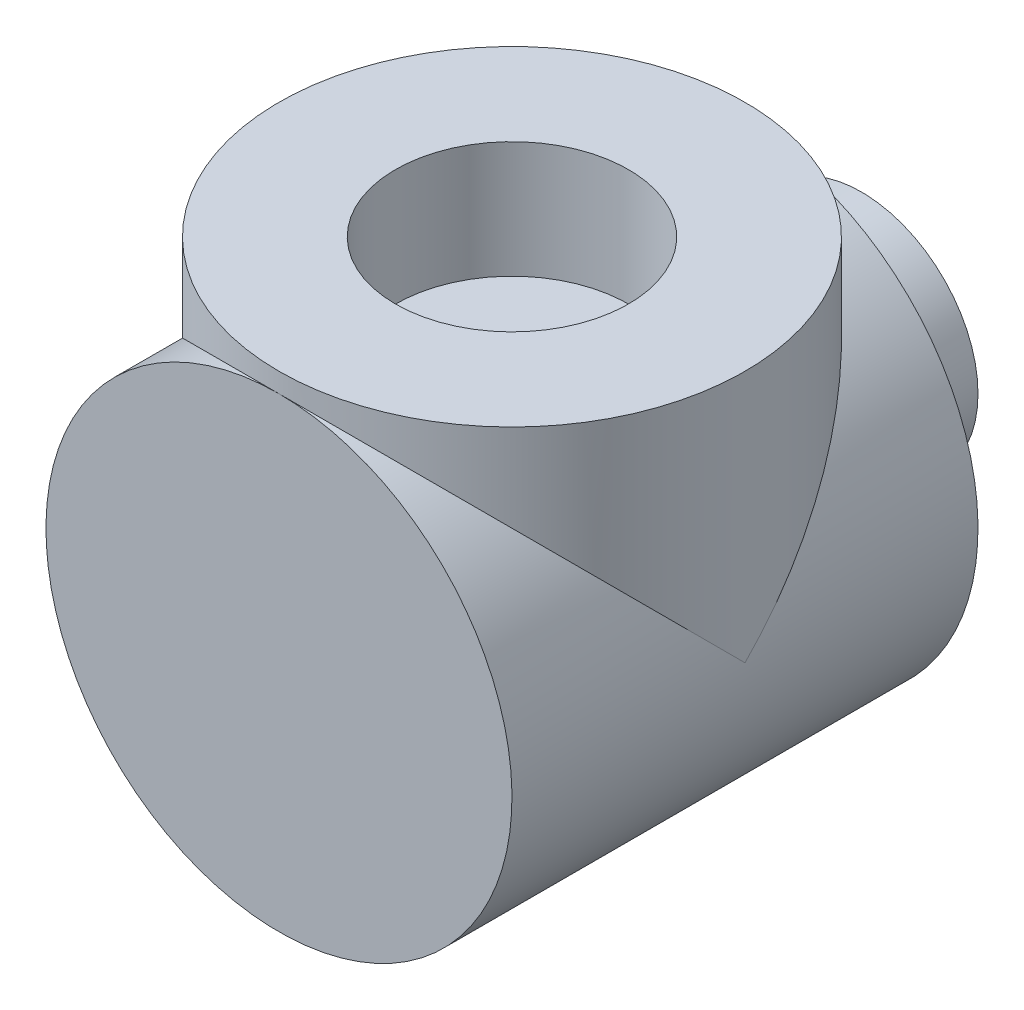
ISO-10303-21;
HEADER;
FILE_DESCRIPTION(('STEP AP214'),'2;1');
FILE_NAME('part.step','',(''),(''),'','','');
FILE_SCHEMA(('AUTOMOTIVE_DESIGN { 1 0 10303 214 1 1 1 1 }'));
ENDSEC;
DATA;
#1=APPLICATION_CONTEXT('core data for automotive mechanical design processes');
#2=APPLICATION_PROTOCOL_DEFINITION('international standard','automotive_design',2000,#1);
#3=PRODUCT_CONTEXT('',#1,'mechanical');
#4=PRODUCT('Part','Part','',(#3));
#5=PRODUCT_RELATED_PRODUCT_CATEGORY('part','',(#4));
#6=PRODUCT_DEFINITION_FORMATION('','',#4);
#7=PRODUCT_DEFINITION_CONTEXT('part definition',#1,'design');
#8=PRODUCT_DEFINITION('design','',#6,#7);
#9=PRODUCT_DEFINITION_SHAPE('','',#8);
#10=(LENGTH_UNIT() NAMED_UNIT(*) SI_UNIT(.MILLI.,.METRE.));
#11=(NAMED_UNIT(*) PLANE_ANGLE_UNIT() SI_UNIT($,.RADIAN.));
#12=(NAMED_UNIT(*) SI_UNIT($,.STERADIAN.) SOLID_ANGLE_UNIT());
#13=UNCERTAINTY_MEASURE_WITH_UNIT(LENGTH_MEASURE(1.E-05),#10,'distance_accuracy_value','');
#14=(GEOMETRIC_REPRESENTATION_CONTEXT(3) GLOBAL_UNCERTAINTY_ASSIGNED_CONTEXT((#13)) GLOBAL_UNIT_ASSIGNED_CONTEXT((#10,
#11,#12)) REPRESENTATION_CONTEXT('',''));
#15=CARTESIAN_POINT('',(0.,0.,0.));
#16=DIRECTION('',(0.,0.,1.));
#17=DIRECTION('',(1.,0.,0.));
#18=AXIS2_PLACEMENT_3D('',#15,#16,#17);
#19=CARTESIAN_POINT('',(0.,0.,30.));
#20=DIRECTION('',(0.,0.,-1.));
#21=DIRECTION('',(-1.,0.,0.));
#22=AXIS2_PLACEMENT_3D('',#19,#20,#21);
#23=CYLINDRICAL_SURFACE('',#22,30.);
#24=CARTESIAN_POINT('',(0.,0.,0.));
#25=DIRECTION('',(0.,-0.707106781186547,-0.707106781186547));
#26=DIRECTION('',(0.,0.707106781186547,-0.707106781186547));
#27=AXIS2_PLACEMENT_3D('',#24,#25,#26);
#28=ELLIPSE('',#27,42.4264068711928,30.);
#29=CARTESIAN_POINT('',(30.,0.,0.));
#30=VERTEX_POINT('',#29);
#31=CARTESIAN_POINT('',(0.,30.,-30.));
#32=VERTEX_POINT('',#31);
#33=EDGE_CURVE('E74',#30,#32,#28,.F.);
#34=ORIENTED_EDGE('',*,*,#33,.F.);
#35=CARTESIAN_POINT('',(0.,0.,0.));
#36=DIRECTION('',(0.,0.707106781186547,-0.707106781186547));
#37=DIRECTION('',(0.,-0.707106781186547,-0.707106781186547));
#38=AXIS2_PLACEMENT_3D('',#35,#36,#37);
#39=ELLIPSE('',#38,42.4264068711928,30.);
#40=CARTESIAN_POINT('',(0.,30.,30.));
#41=VERTEX_POINT('',#40);
#42=EDGE_CURVE('E68',#41,#30,#39,.T.);
#43=ORIENTED_EDGE('',*,*,#42,.F.);
#44=CARTESIAN_POINT('',(0.,0.,30.));
#45=DIRECTION('',(0.,0.,1.));
#46=DIRECTION('',(1.,0.,0.));
#47=AXIS2_PLACEMENT_3D('',#44,#45,#46);
#48=CIRCLE('',#47,30.);
#49=EDGE_CURVE('E13',#41,#41,#48,.T.);
#50=ORIENTED_EDGE('',*,*,#49,.F.);
#51=CARTESIAN_POINT('',(-30.,0.,0.));
#52=VERTEX_POINT('',#51);
#53=EDGE_CURVE('E62',#52,#41,#39,.T.);
#54=ORIENTED_EDGE('',*,*,#53,.F.);
#55=EDGE_CURVE('E78',#32,#52,#28,.F.);
#56=ORIENTED_EDGE('',*,*,#55,.F.);
#57=CARTESIAN_POINT('',(0.,0.,-30.));
#58=DIRECTION('',(0.,0.,1.));
#59=DIRECTION('',(1.,0.,0.));
#60=AXIS2_PLACEMENT_3D('',#57,#58,#59);
#61=CIRCLE('',#60,30.);
#62=EDGE_CURVE('E51',#32,#32,#61,.T.);
#63=ORIENTED_EDGE('',*,*,#62,.T.);
#64=EDGE_LOOP('',(#34,#43,#50,#54,#56,#63));
#65=FACE_BOUND('',#64,.T.);
#66=ADVANCED_FACE('F48',(#65),#23,.T.);
#67=CARTESIAN_POINT('',(0.,0.,30.));
#68=DIRECTION('',(0.,0.,1.));
#69=DIRECTION('',(1.,0.,0.));
#70=AXIS2_PLACEMENT_3D('',#67,#68,#69);
#71=PLANE('',#70);
#72=ORIENTED_EDGE('',*,*,#49,.T.);
#73=EDGE_LOOP('',(#72));
#74=FACE_BOUND('',#73,.T.);
#75=ADVANCED_FACE('F110',(#74),#71,.T.);
#76=CARTESIAN_POINT('',(0.,0.,-30.));
#77=DIRECTION('',(0.,0.,1.));
#78=DIRECTION('',(1.,0.,0.));
#79=AXIS2_PLACEMENT_3D('',#76,#77,#78);
#80=PLANE('',#79);
#81=CARTESIAN_POINT('',(0.,0.,-30.));
#82=DIRECTION('',(0.,0.,1.));
#83=DIRECTION('',(1.,0.,0.));
#84=AXIS2_PLACEMENT_3D('',#81,#82,#83);
#85=CIRCLE('',#84,15.);
#86=CARTESIAN_POINT('',(15.,0.,-30.));
#87=VERTEX_POINT('',#86);
#88=EDGE_CURVE('E92',#87,#87,#85,.T.);
#89=ORIENTED_EDGE('',*,*,#88,.T.);
#90=EDGE_LOOP('',(#89));
#91=FACE_BOUND('',#90,.T.);
#92=ORIENTED_EDGE('',*,*,#62,.F.);
#93=EDGE_LOOP('',(#92));
#94=FACE_BOUND('',#93,.T.);
#95=ADVANCED_FACE('F114',(#91,#94),#80,.F.);
#96=CARTESIAN_POINT('',(0.,32.5,0.));
#97=DIRECTION('',(0.,-1.,0.));
#98=DIRECTION('',(0.,0.,-1.));
#99=AXIS2_PLACEMENT_3D('',#96,#97,#98);
#100=CYLINDRICAL_SURFACE('',#99,30.);
#101=CARTESIAN_POINT('',(0.,32.5,0.));
#102=DIRECTION('',(0.,1.,0.));
#103=DIRECTION('',(0.,0.,1.));
#104=AXIS2_PLACEMENT_3D('',#101,#102,#103);
#105=CIRCLE('',#104,30.);
#106=CARTESIAN_POINT('',(0.,32.5,30.));
#107=VERTEX_POINT('',#106);
#108=EDGE_CURVE('E82',#107,#107,#105,.T.);
#109=ORIENTED_EDGE('',*,*,#108,.F.);
#110=EDGE_LOOP('',(#109));
#111=FACE_BOUND('',#110,.T.);
#112=ORIENTED_EDGE('',*,*,#42,.T.);
#113=ORIENTED_EDGE('',*,*,#33,.T.);
#114=ORIENTED_EDGE('',*,*,#55,.T.);
#115=ORIENTED_EDGE('',*,*,#53,.T.);
#116=EDGE_LOOP('',(#112,#113,#114,#115));
#117=FACE_BOUND('',#116,.T.);
#118=ADVANCED_FACE('F79',(#111,#117),#100,.T.);
#119=CARTESIAN_POINT('',(0.,32.5,0.));
#120=DIRECTION('',(0.,1.,0.));
#121=DIRECTION('',(0.,0.,1.));
#122=AXIS2_PLACEMENT_3D('',#119,#120,#121);
#123=PLANE('',#122);
#124=CARTESIAN_POINT('',(0.,32.5,0.));
#125=DIRECTION('',(0.,1.,0.));
#126=DIRECTION('',(0.,0.,1.));
#127=AXIS2_PLACEMENT_3D('',#124,#125,#126);
#128=CIRCLE('',#127,15.);
#129=CARTESIAN_POINT('',(0.,32.5,15.));
#130=VERTEX_POINT('',#129);
#131=EDGE_CURVE('E86',#130,#130,#128,.T.);
#132=ORIENTED_EDGE('',*,*,#131,.F.);
#133=EDGE_LOOP('',(#132));
#134=FACE_BOUND('',#133,.T.);
#135=ORIENTED_EDGE('',*,*,#108,.T.);
#136=EDGE_LOOP('',(#135));
#137=FACE_BOUND('',#136,.T.);
#138=ADVANCED_FACE('F124',(#134,#137),#123,.T.);
#139=CARTESIAN_POINT('',(0.,17.5,0.));
#140=DIRECTION('',(0.,1.,0.));
#141=DIRECTION('',(0.,0.,1.));
#142=AXIS2_PLACEMENT_3D('',#139,#140,#141);
#143=CYLINDRICAL_SURFACE('',#142,15.);
#144=CARTESIAN_POINT('',(0.,17.5,0.));
#145=DIRECTION('',(0.,1.,0.));
#146=DIRECTION('',(0.,0.,1.));
#147=AXIS2_PLACEMENT_3D('',#144,#145,#146);
#148=CIRCLE('',#147,15.);
#149=CARTESIAN_POINT('',(0.,17.5,15.));
#150=VERTEX_POINT('',#149);
#151=EDGE_CURVE('E85',#150,#150,#148,.T.);
#152=ORIENTED_EDGE('',*,*,#151,.F.);
#153=EDGE_LOOP('',(#152));
#154=FACE_BOUND('',#153,.T.);
#155=ORIENTED_EDGE('',*,*,#131,.T.);
#156=EDGE_LOOP('',(#155));
#157=FACE_BOUND('',#156,.T.);
#158=ADVANCED_FACE('F128',(#154,#157),#143,.F.);
#159=CARTESIAN_POINT('',(0.,17.5,0.));
#160=DIRECTION('',(0.,1.,0.));
#161=DIRECTION('',(0.,0.,1.));
#162=AXIS2_PLACEMENT_3D('',#159,#160,#161);
#163=PLANE('',#162);
#164=ORIENTED_EDGE('',*,*,#151,.T.);
#165=EDGE_LOOP('',(#164));
#166=FACE_BOUND('',#165,.T.);
#167=ADVANCED_FACE('F107',(#166),#163,.T.);
#168=CARTESIAN_POINT('',(0.,0.,-45.));
#169=DIRECTION('',(0.,0.,1.));
#170=DIRECTION('',(1.,0.,0.));
#171=AXIS2_PLACEMENT_3D('',#168,#169,#170);
#172=CYLINDRICAL_SURFACE('',#171,15.);
#173=CARTESIAN_POINT('',(0.,0.,-45.));
#174=DIRECTION('',(0.,0.,1.));
#175=DIRECTION('',(1.,0.,0.));
#176=AXIS2_PLACEMENT_3D('',#173,#174,#175);
#177=CIRCLE('',#176,15.);
#178=CARTESIAN_POINT('',(15.,0.,-45.));
#179=VERTEX_POINT('',#178);
#180=EDGE_CURVE('E89',#179,#179,#177,.T.);
#181=ORIENTED_EDGE('',*,*,#180,.T.);
#182=EDGE_LOOP('',(#181));
#183=FACE_BOUND('',#182,.T.);
#184=ORIENTED_EDGE('',*,*,#88,.F.);
#185=EDGE_LOOP('',(#184));
#186=FACE_BOUND('',#185,.T.);
#187=ADVANCED_FACE('F98',(#183,#186),#172,.T.);
#188=CARTESIAN_POINT('',(0.,0.,-45.));
#189=DIRECTION('',(0.,0.,1.));
#190=DIRECTION('',(1.,0.,0.));
#191=AXIS2_PLACEMENT_3D('',#188,#189,#190);
#192=PLANE('',#191);
#193=ORIENTED_EDGE('',*,*,#180,.F.);
#194=EDGE_LOOP('',(#193));
#195=FACE_BOUND('',#194,.T.);
#196=ADVANCED_FACE('F101',(#195),#192,.F.);
#197=CLOSED_SHELL('',(#66,#75,#95,#118,#138,#158,#167,#187,#196));
#198=MANIFOLD_SOLID_BREP('B2',#197);
#199=ADVANCED_BREP_SHAPE_REPRESENTATION('',(#18,#198),#14);
#200=SHAPE_DEFINITION_REPRESENTATION(#9,#199);
ENDSEC;
END-ISO-10303-21;
